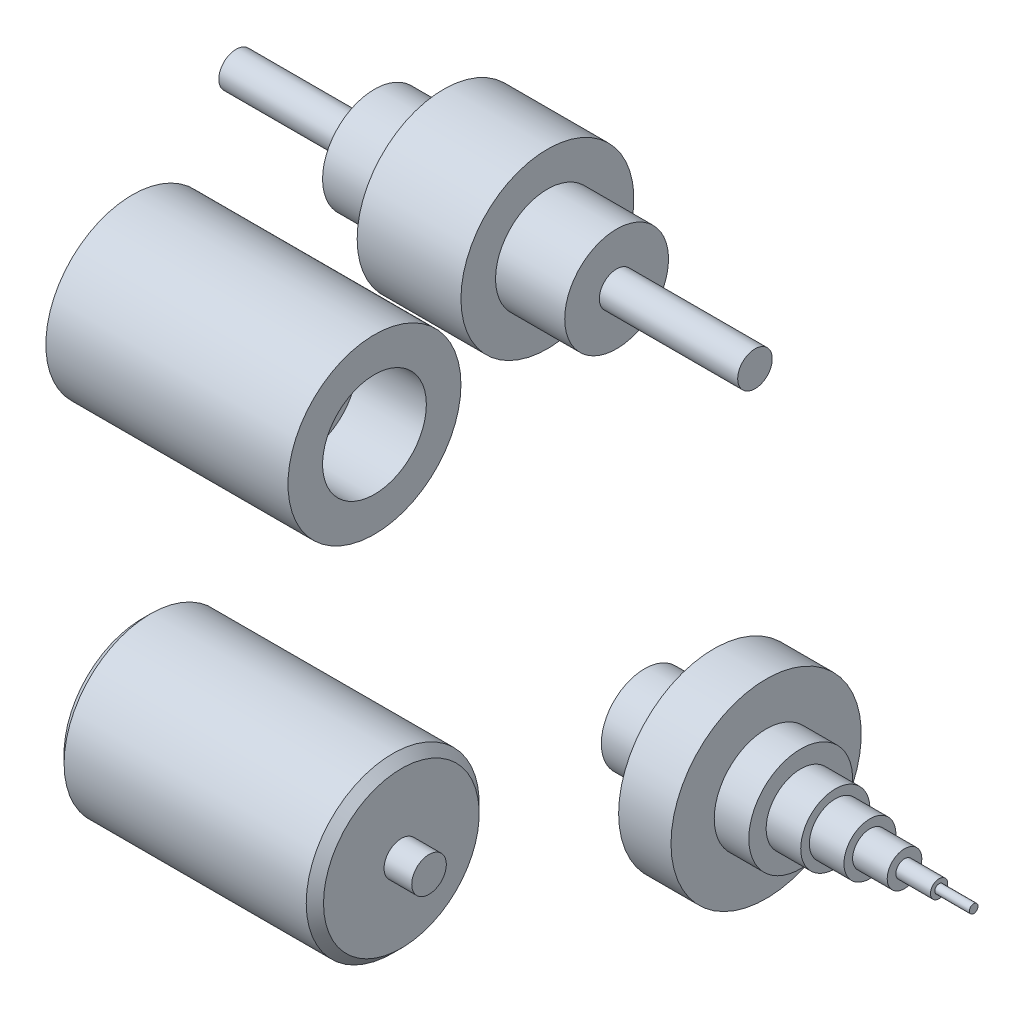
ISO-10303-21;
HEADER;
FILE_DESCRIPTION(('STEP AP214'),'2;1');
FILE_NAME('part.step','',(''),(''),'','','');
FILE_SCHEMA(('AUTOMOTIVE_DESIGN { 1 0 10303 214 1 1 1 1 }'));
ENDSEC;
DATA;
#1=APPLICATION_CONTEXT('core data for automotive mechanical design processes');
#2=APPLICATION_PROTOCOL_DEFINITION('international standard','automotive_design',2000,#1);
#3=PRODUCT_CONTEXT('',#1,'mechanical');
#4=PRODUCT('Part','Part','',(#3));
#5=PRODUCT_RELATED_PRODUCT_CATEGORY('part','',(#4));
#6=PRODUCT_DEFINITION_FORMATION('','',#4);
#7=PRODUCT_DEFINITION_CONTEXT('part definition',#1,'design');
#8=PRODUCT_DEFINITION('design','',#6,#7);
#9=PRODUCT_DEFINITION_SHAPE('','',#8);
#10=(LENGTH_UNIT() NAMED_UNIT(*) SI_UNIT(.MILLI.,.METRE.));
#11=(NAMED_UNIT(*) PLANE_ANGLE_UNIT() SI_UNIT($,.RADIAN.));
#12=(NAMED_UNIT(*) SI_UNIT($,.STERADIAN.) SOLID_ANGLE_UNIT());
#13=UNCERTAINTY_MEASURE_WITH_UNIT(LENGTH_MEASURE(1.E-05),#10,'distance_accuracy_value','');
#14=(GEOMETRIC_REPRESENTATION_CONTEXT(3) GLOBAL_UNCERTAINTY_ASSIGNED_CONTEXT((#13)) GLOBAL_UNIT_ASSIGNED_CONTEXT((#10,
#11,#12)) REPRESENTATION_CONTEXT('',''));
#15=CARTESIAN_POINT('',(0.,0.,0.));
#16=DIRECTION('',(0.,0.,1.));
#17=DIRECTION('',(1.,0.,0.));
#18=AXIS2_PLACEMENT_3D('',#15,#16,#17);
#19=CARTESIAN_POINT('',(-110.390362139245,-415.362975233975,0.));
#20=DIRECTION('',(-1.,0.,0.));
#21=DIRECTION('',(0.,0.,1.));
#22=AXIS2_PLACEMENT_3D('',#19,#20,#21);
#23=CYLINDRICAL_SURFACE('',#22,9.99999999999998);
#24=CARTESIAN_POINT('',(-86.5716986059651,-415.362975233975,0.));
#25=DIRECTION('',(-1.,0.,0.));
#26=DIRECTION('',(0.,0.,1.));
#27=AXIS2_PLACEMENT_3D('',#24,#25,#26);
#28=CIRCLE('',#27,10.);
#29=CARTESIAN_POINT('',(-86.5716986059651,-415.362975233975,10.));
#30=VERTEX_POINT('',#29);
#31=EDGE_CURVE('E62',#30,#30,#28,.T.);
#32=ORIENTED_EDGE('',*,*,#31,.F.);
#33=EDGE_LOOP('',(#32));
#34=FACE_BOUND('',#33,.T.);
#35=CARTESIAN_POINT('',(-70.5716986059651,-415.362975233975,0.));
#36=DIRECTION('',(-1.,0.,0.));
#37=DIRECTION('',(0.,0.,1.));
#38=AXIS2_PLACEMENT_3D('',#35,#36,#37);
#39=CIRCLE('',#38,9.99999999999995);
#40=CARTESIAN_POINT('',(-70.5716986059651,-415.362975233975,9.99999999999995));
#41=VERTEX_POINT('',#40);
#42=EDGE_CURVE('E71',#41,#41,#39,.T.);
#43=ORIENTED_EDGE('',*,*,#42,.T.);
#44=EDGE_LOOP('',(#43));
#45=FACE_BOUND('',#44,.T.);
#46=ADVANCED_FACE('F42',(#34,#45),#23,.T.);
#47=CARTESIAN_POINT('',(-86.5716986059651,-415.362975233975,0.));
#48=DIRECTION('',(1.,0.,0.));
#49=DIRECTION('',(0.,0.,-1.));
#50=AXIS2_PLACEMENT_3D('',#47,#48,#49);
#51=PLANE('',#50);
#52=ORIENTED_EDGE('',*,*,#31,.T.);
#53=EDGE_LOOP('',(#52));
#54=FACE_BOUND('',#53,.T.);
#55=ADVANCED_FACE('F90',(#54),#51,.F.);
#56=CARTESIAN_POINT('',(95.4283013940349,-405.362975233975,0.));
#57=DIRECTION('',(-1.,0.,0.));
#58=DIRECTION('',(0.,0.,1.));
#59=AXIS2_PLACEMENT_3D('',#56,#57,#58);
#60=PLANE('',#59);
#61=CARTESIAN_POINT('',(95.4283013940349,-415.362975233975,0.));
#62=DIRECTION('',(-1.,0.,0.));
#63=DIRECTION('',(0.,0.,1.));
#64=AXIS2_PLACEMENT_3D('',#61,#62,#63);
#65=CIRCLE('',#64,9.99999999999995);
#66=CARTESIAN_POINT('',(95.4283013940349,-415.362975233975,9.99999999999995));
#67=VERTEX_POINT('',#66);
#68=EDGE_CURVE('E65',#67,#67,#65,.T.);
#69=ORIENTED_EDGE('',*,*,#68,.F.);
#70=EDGE_LOOP('',(#69));
#71=FACE_BOUND('',#70,.T.);
#72=ADVANCED_FACE('F96',(#71),#60,.F.);
#73=CARTESIAN_POINT('',(-110.390362139245,-415.362975233975,0.));
#74=DIRECTION('',(-1.,0.,0.));
#75=DIRECTION('',(0.,0.,1.));
#76=AXIS2_PLACEMENT_3D('',#73,#74,#75);
#77=CYLINDRICAL_SURFACE('',#76,9.99999999999995);
#78=CARTESIAN_POINT('',(79.4283013940349,-415.362975233975,0.));
#79=DIRECTION('',(-1.,0.,0.));
#80=DIRECTION('',(0.,0.,1.));
#81=AXIS2_PLACEMENT_3D('',#78,#79,#80);
#82=CIRCLE('',#81,9.99999999999995);
#83=CARTESIAN_POINT('',(79.4283013940349,-415.362975233975,9.99999999999995));
#84=VERTEX_POINT('',#83);
#85=EDGE_CURVE('E68',#84,#84,#82,.T.);
#86=ORIENTED_EDGE('',*,*,#85,.F.);
#87=EDGE_LOOP('',(#86));
#88=FACE_BOUND('',#87,.T.);
#89=ORIENTED_EDGE('',*,*,#68,.T.);
#90=EDGE_LOOP('',(#89));
#91=FACE_BOUND('',#90,.T.);
#92=ADVANCED_FACE('F103',(#88,#91),#77,.T.);
#93=CARTESIAN_POINT('',(79.4283013940349,-365.362975233975,0.));
#94=DIRECTION('',(-1.,0.,0.));
#95=DIRECTION('',(0.,0.,1.));
#96=AXIS2_PLACEMENT_3D('',#93,#94,#95);
#97=PLANE('',#96);
#98=CARTESIAN_POINT('',(79.4283013940349,-415.362975233975,0.));
#99=DIRECTION('',(-1.,0.,0.));
#100=DIRECTION('',(0.,0.,1.));
#101=AXIS2_PLACEMENT_3D('',#98,#99,#100);
#102=CIRCLE('',#101,45.);
#103=CARTESIAN_POINT('',(79.4283013940349,-415.362975233975,45.));
#104=VERTEX_POINT('',#103);
#105=EDGE_CURVE('E11',#104,#104,#102,.F.);
#106=ORIENTED_EDGE('',*,*,#105,.T.);
#107=EDGE_LOOP('',(#106));
#108=FACE_BOUND('',#107,.T.);
#109=ORIENTED_EDGE('',*,*,#85,.T.);
#110=EDGE_LOOP('',(#109));
#111=FACE_BOUND('',#110,.T.);
#112=ADVANCED_FACE('F87',(#108,#111),#97,.F.);
#113=CARTESIAN_POINT('',(-110.390362139245,-415.362975233975,0.));
#114=DIRECTION('',(-1.,0.,0.));
#115=DIRECTION('',(0.,0.,1.));
#116=AXIS2_PLACEMENT_3D('',#113,#114,#115);
#117=CYLINDRICAL_SURFACE('',#116,49.9999999999999);
#118=CARTESIAN_POINT('',(74.4283013940349,-415.362975233975,0.));
#119=DIRECTION('',(-1.,0.,0.));
#120=DIRECTION('',(0.,0.,1.));
#121=AXIS2_PLACEMENT_3D('',#118,#119,#120);
#122=CIRCLE('',#121,49.9999999999999);
#123=CARTESIAN_POINT('',(74.4283013940349,-415.362975233975,49.9999999999999));
#124=VERTEX_POINT('',#123);
#125=EDGE_CURVE('E49',#124,#124,#122,.T.);
#126=ORIENTED_EDGE('',*,*,#125,.T.);
#127=EDGE_LOOP('',(#126));
#128=FACE_BOUND('',#127,.T.);
#129=CARTESIAN_POINT('',(-65.5716986059651,-415.362975233975,0.));
#130=DIRECTION('',(1.,0.,0.));
#131=DIRECTION('',(0.,0.,-1.));
#132=AXIS2_PLACEMENT_3D('',#129,#130,#131);
#133=CIRCLE('',#132,49.9999999999999);
#134=CARTESIAN_POINT('',(-65.5716986059651,-415.362975233975,-49.9999999999999));
#135=VERTEX_POINT('',#134);
#136=EDGE_CURVE('E53',#135,#135,#133,.T.);
#137=ORIENTED_EDGE('',*,*,#136,.T.);
#138=EDGE_LOOP('',(#137));
#139=FACE_BOUND('',#138,.T.);
#140=ADVANCED_FACE('F79',(#128,#139),#117,.T.);
#141=CARTESIAN_POINT('',(-70.5716986059651,-405.362975233975,0.));
#142=DIRECTION('',(1.,0.,0.));
#143=DIRECTION('',(0.,0.,-1.));
#144=AXIS2_PLACEMENT_3D('',#141,#142,#143);
#145=PLANE('',#144);
#146=CARTESIAN_POINT('',(-70.5716986059651,-415.362975233975,0.));
#147=DIRECTION('',(1.,0.,0.));
#148=DIRECTION('',(0.,0.,-1.));
#149=AXIS2_PLACEMENT_3D('',#146,#147,#148);
#150=CIRCLE('',#149,44.9999999999999);
#151=CARTESIAN_POINT('',(-70.5716986059651,-415.362975233975,-44.9999999999999));
#152=VERTEX_POINT('',#151);
#153=EDGE_CURVE('E57',#152,#152,#150,.F.);
#154=ORIENTED_EDGE('',*,*,#153,.T.);
#155=EDGE_LOOP('',(#154));
#156=FACE_BOUND('',#155,.T.);
#157=ORIENTED_EDGE('',*,*,#42,.F.);
#158=EDGE_LOOP('',(#157));
#159=FACE_BOUND('',#158,.T.);
#160=ADVANCED_FACE('F76',(#156,#159),#145,.F.);
#161=CARTESIAN_POINT('',(-70.5716986059651,-415.362975233975,0.));
#162=DIRECTION('',(1.,0.,0.));
#163=DIRECTION('',(0.,0.,-1.));
#164=AXIS2_PLACEMENT_3D('',#161,#162,#163);
#165=CONICAL_SURFACE('',#164,44.9999999999999,0.785398163397446);
#166=ORIENTED_EDGE('',*,*,#136,.F.);
#167=EDGE_LOOP('',(#166));
#168=FACE_BOUND('',#167,.T.);
#169=ORIENTED_EDGE('',*,*,#153,.F.);
#170=EDGE_LOOP('',(#169));
#171=FACE_BOUND('',#170,.T.);
#172=ADVANCED_FACE('F78',(#168,#171),#165,.T.);
#173=CARTESIAN_POINT('',(74.4283013940349,-415.362975233975,0.));
#174=DIRECTION('',(-1.,0.,0.));
#175=DIRECTION('',(0.,0.,1.));
#176=AXIS2_PLACEMENT_3D('',#173,#174,#175);
#177=CONICAL_SURFACE('',#176,49.9999999999999,0.785398163397451);
#178=ORIENTED_EDGE('',*,*,#105,.F.);
#179=EDGE_LOOP('',(#178));
#180=FACE_BOUND('',#179,.T.);
#181=ORIENTED_EDGE('',*,*,#125,.F.);
#182=EDGE_LOOP('',(#181));
#183=FACE_BOUND('',#182,.T.);
#184=ADVANCED_FACE('F44',(#180,#183),#177,.T.);
#185=CLOSED_SHELL('',(#46,#55,#72,#92,#112,#140,#160,#172,#184));
#186=MANIFOLD_SOLID_BREP('B2',#185);
#187=CARTESIAN_POINT('',(410.329396223316,-275.079193053094,0.));
#188=DIRECTION('',(1.,0.,0.));
#189=DIRECTION('',(0.,0.,-1.));
#190=AXIS2_PLACEMENT_3D('',#187,#188,#189);
#191=PLANE('',#190);
#192=CARTESIAN_POINT('',(410.329396223316,-275.079193053094,0.));
#193=DIRECTION('',(-1.,0.,0.));
#194=DIRECTION('',(0.,0.,1.));
#195=AXIS2_PLACEMENT_3D('',#192,#193,#194);
#196=CIRCLE('',#195,2.5);
#197=CARTESIAN_POINT('',(410.329396223316,-275.079193053094,2.5));
#198=VERTEX_POINT('',#197);
#199=EDGE_CURVE('E41',#198,#198,#196,.T.);
#200=ORIENTED_EDGE('',*,*,#199,.F.);
#201=EDGE_LOOP('',(#200));
#202=FACE_BOUND('',#201,.T.);
#203=ADVANCED_FACE('F181',(#202),#191,.T.);
#204=CARTESIAN_POINT('',(141.076094876442,-275.079193053094,0.));
#205=DIRECTION('',(-1.,0.,0.));
#206=DIRECTION('',(0.,0.,1.));
#207=AXIS2_PLACEMENT_3D('',#204,#205,#206);
#208=CYLINDRICAL_SURFACE('',#207,2.50000000000003);
#209=ORIENTED_EDGE('',*,*,#199,.T.);
#210=EDGE_LOOP('',(#209));
#211=FACE_BOUND('',#210,.T.);
#212=CARTESIAN_POINT('',(390.329396223316,-275.079193053094,0.));
#213=DIRECTION('',(-1.,0.,0.));
#214=DIRECTION('',(0.,0.,1.));
#215=AXIS2_PLACEMENT_3D('',#212,#213,#214);
#216=CIRCLE('',#215,2.50000000000006);
#217=CARTESIAN_POINT('',(390.329396223316,-275.079193053094,2.50000000000006));
#218=VERTEX_POINT('',#217);
#219=EDGE_CURVE('E187',#218,#218,#216,.T.);
#220=ORIENTED_EDGE('',*,*,#219,.F.);
#221=EDGE_LOOP('',(#220));
#222=FACE_BOUND('',#221,.T.);
#223=ADVANCED_FACE('F269',(#211,#222),#208,.T.);
#224=CARTESIAN_POINT('',(390.329396223316,-277.579193053094,0.));
#225=DIRECTION('',(1.,0.,0.));
#226=DIRECTION('',(0.,0.,-1.));
#227=AXIS2_PLACEMENT_3D('',#224,#225,#226);
#228=PLANE('',#227);
#229=ORIENTED_EDGE('',*,*,#219,.T.);
#230=EDGE_LOOP('',(#229));
#231=FACE_BOUND('',#230,.T.);
#232=CARTESIAN_POINT('',(390.329396223316,-275.079193053094,0.));
#233=DIRECTION('',(-1.,0.,0.));
#234=DIRECTION('',(0.,0.,1.));
#235=AXIS2_PLACEMENT_3D('',#232,#233,#234);
#236=CIRCLE('',#235,5.);
#237=CARTESIAN_POINT('',(390.329396223316,-275.079193053094,5.));
#238=VERTEX_POINT('',#237);
#239=EDGE_CURVE('E191',#238,#238,#236,.T.);
#240=ORIENTED_EDGE('',*,*,#239,.F.);
#241=EDGE_LOOP('',(#240));
#242=FACE_BOUND('',#241,.T.);
#243=ADVANCED_FACE('F274',(#231,#242),#228,.T.);
#244=CARTESIAN_POINT('',(141.076094876442,-275.079193053094,0.));
#245=DIRECTION('',(-1.,0.,0.));
#246=DIRECTION('',(0.,0.,1.));
#247=AXIS2_PLACEMENT_3D('',#244,#245,#246);
#248=CYLINDRICAL_SURFACE('',#247,5.);
#249=ORIENTED_EDGE('',*,*,#239,.T.);
#250=EDGE_LOOP('',(#249));
#251=FACE_BOUND('',#250,.T.);
#252=CARTESIAN_POINT('',(370.329396223316,-275.079193053094,0.));
#253=DIRECTION('',(-1.,0.,0.));
#254=DIRECTION('',(0.,0.,1.));
#255=AXIS2_PLACEMENT_3D('',#252,#253,#254);
#256=CIRCLE('',#255,5.);
#257=CARTESIAN_POINT('',(370.329396223316,-275.079193053094,5.));
#258=VERTEX_POINT('',#257);
#259=EDGE_CURVE('E195',#258,#258,#256,.T.);
#260=ORIENTED_EDGE('',*,*,#259,.F.);
#261=EDGE_LOOP('',(#260));
#262=FACE_BOUND('',#261,.T.);
#263=ADVANCED_FACE('F278',(#251,#262),#248,.T.);
#264=CARTESIAN_POINT('',(370.329396223316,-280.079193053094,0.));
#265=DIRECTION('',(1.,0.,0.));
#266=DIRECTION('',(0.,0.,-1.));
#267=AXIS2_PLACEMENT_3D('',#264,#265,#266);
#268=PLANE('',#267);
#269=ORIENTED_EDGE('',*,*,#259,.T.);
#270=EDGE_LOOP('',(#269));
#271=FACE_BOUND('',#270,.T.);
#272=CARTESIAN_POINT('',(370.329396223316,-275.079193053094,0.));
#273=DIRECTION('',(-1.,0.,0.));
#274=DIRECTION('',(0.,0.,1.));
#275=AXIS2_PLACEMENT_3D('',#272,#273,#274);
#276=CIRCLE('',#275,10.);
#277=CARTESIAN_POINT('',(370.329396223316,-275.079193053094,10.));
#278=VERTEX_POINT('',#277);
#279=EDGE_CURVE('E200',#278,#278,#276,.T.);
#280=ORIENTED_EDGE('',*,*,#279,.F.);
#281=EDGE_LOOP('',(#280));
#282=FACE_BOUND('',#281,.T.);
#283=ADVANCED_FACE('F284',(#271,#282),#268,.T.);
#284=CARTESIAN_POINT('',(141.076094876442,-275.079193053094,0.));
#285=DIRECTION('',(-1.,0.,0.));
#286=DIRECTION('',(0.,0.,1.));
#287=AXIS2_PLACEMENT_3D('',#284,#285,#286);
#288=CYLINDRICAL_SURFACE('',#287,10.);
#289=ORIENTED_EDGE('',*,*,#279,.T.);
#290=EDGE_LOOP('',(#289));
#291=FACE_BOUND('',#290,.T.);
#292=CARTESIAN_POINT('',(350.329396223316,-275.079193053094,0.));
#293=DIRECTION('',(-1.,0.,0.));
#294=DIRECTION('',(0.,0.,1.));
#295=AXIS2_PLACEMENT_3D('',#292,#293,#294);
#296=CIRCLE('',#295,10.);
#297=CARTESIAN_POINT('',(350.329396223316,-275.079193053094,10.));
#298=VERTEX_POINT('',#297);
#299=EDGE_CURVE('E203',#298,#298,#296,.T.);
#300=ORIENTED_EDGE('',*,*,#299,.F.);
#301=EDGE_LOOP('',(#300));
#302=FACE_BOUND('',#301,.T.);
#303=ADVANCED_FACE('F288',(#291,#302),#288,.T.);
#304=CARTESIAN_POINT('',(350.329396223316,-285.079193053094,0.));
#305=DIRECTION('',(1.,0.,0.));
#306=DIRECTION('',(0.,0.,-1.));
#307=AXIS2_PLACEMENT_3D('',#304,#305,#306);
#308=PLANE('',#307);
#309=ORIENTED_EDGE('',*,*,#299,.T.);
#310=EDGE_LOOP('',(#309));
#311=FACE_BOUND('',#310,.T.);
#312=CARTESIAN_POINT('',(350.329396223316,-275.079193053094,0.));
#313=DIRECTION('',(-1.,0.,0.));
#314=DIRECTION('',(0.,0.,1.));
#315=AXIS2_PLACEMENT_3D('',#312,#313,#314);
#316=CIRCLE('',#315,15.);
#317=CARTESIAN_POINT('',(350.329396223316,-275.079193053094,15.));
#318=VERTEX_POINT('',#317);
#319=EDGE_CURVE('E206',#318,#318,#316,.T.);
#320=ORIENTED_EDGE('',*,*,#319,.F.);
#321=EDGE_LOOP('',(#320));
#322=FACE_BOUND('',#321,.T.);
#323=ADVANCED_FACE('F292',(#311,#322),#308,.T.);
#324=CARTESIAN_POINT('',(141.076094876442,-275.079193053094,0.));
#325=DIRECTION('',(-1.,0.,0.));
#326=DIRECTION('',(0.,0.,1.));
#327=AXIS2_PLACEMENT_3D('',#324,#325,#326);
#328=CYLINDRICAL_SURFACE('',#327,15.);
#329=ORIENTED_EDGE('',*,*,#319,.T.);
#330=EDGE_LOOP('',(#329));
#331=FACE_BOUND('',#330,.T.);
#332=CARTESIAN_POINT('',(330.329396223316,-275.079193053094,0.));
#333=DIRECTION('',(-1.,0.,0.));
#334=DIRECTION('',(0.,0.,1.));
#335=AXIS2_PLACEMENT_3D('',#332,#333,#334);
#336=CIRCLE('',#335,15.);
#337=CARTESIAN_POINT('',(330.329396223316,-275.079193053094,15.));
#338=VERTEX_POINT('',#337);
#339=EDGE_CURVE('E209',#338,#338,#336,.T.);
#340=ORIENTED_EDGE('',*,*,#339,.F.);
#341=EDGE_LOOP('',(#340));
#342=FACE_BOUND('',#341,.T.);
#343=ADVANCED_FACE('F296',(#331,#342),#328,.T.);
#344=CARTESIAN_POINT('',(330.329396223316,-290.079193053094,0.));
#345=DIRECTION('',(1.,0.,0.));
#346=DIRECTION('',(0.,0.,-1.));
#347=AXIS2_PLACEMENT_3D('',#344,#345,#346);
#348=PLANE('',#347);
#349=ORIENTED_EDGE('',*,*,#339,.T.);
#350=EDGE_LOOP('',(#349));
#351=FACE_BOUND('',#350,.T.);
#352=CARTESIAN_POINT('',(330.329396223316,-275.079193053094,0.));
#353=DIRECTION('',(-1.,0.,0.));
#354=DIRECTION('',(0.,0.,1.));
#355=AXIS2_PLACEMENT_3D('',#352,#353,#354);
#356=CIRCLE('',#355,20.);
#357=CARTESIAN_POINT('',(330.329396223316,-275.079193053094,20.));
#358=VERTEX_POINT('',#357);
#359=EDGE_CURVE('E212',#358,#358,#356,.T.);
#360=ORIENTED_EDGE('',*,*,#359,.F.);
#361=EDGE_LOOP('',(#360));
#362=FACE_BOUND('',#361,.T.);
#363=ADVANCED_FACE('F300',(#351,#362),#348,.T.);
#364=CARTESIAN_POINT('',(141.076094876442,-275.079193053094,0.));
#365=DIRECTION('',(-1.,0.,0.));
#366=DIRECTION('',(0.,0.,1.));
#367=AXIS2_PLACEMENT_3D('',#364,#365,#366);
#368=CYLINDRICAL_SURFACE('',#367,20.);
#369=ORIENTED_EDGE('',*,*,#359,.T.);
#370=EDGE_LOOP('',(#369));
#371=FACE_BOUND('',#370,.T.);
#372=CARTESIAN_POINT('',(310.329396223316,-275.079193053094,0.));
#373=DIRECTION('',(-1.,0.,0.));
#374=DIRECTION('',(0.,0.,1.));
#375=AXIS2_PLACEMENT_3D('',#372,#373,#374);
#376=CIRCLE('',#375,20.);
#377=CARTESIAN_POINT('',(310.329396223316,-275.079193053094,20.));
#378=VERTEX_POINT('',#377);
#379=EDGE_CURVE('E215',#378,#378,#376,.T.);
#380=ORIENTED_EDGE('',*,*,#379,.F.);
#381=EDGE_LOOP('',(#380));
#382=FACE_BOUND('',#381,.T.);
#383=ADVANCED_FACE('F304',(#371,#382),#368,.T.);
#384=CARTESIAN_POINT('',(310.329396223316,-295.079193053094,0.));
#385=DIRECTION('',(1.,0.,0.));
#386=DIRECTION('',(0.,0.,-1.));
#387=AXIS2_PLACEMENT_3D('',#384,#385,#386);
#388=PLANE('',#387);
#389=ORIENTED_EDGE('',*,*,#379,.T.);
#390=EDGE_LOOP('',(#389));
#391=FACE_BOUND('',#390,.T.);
#392=CARTESIAN_POINT('',(310.329396223316,-275.079193053094,0.));
#393=DIRECTION('',(-1.,0.,0.));
#394=DIRECTION('',(0.,0.,1.));
#395=AXIS2_PLACEMENT_3D('',#392,#393,#394);
#396=CIRCLE('',#395,30.);
#397=CARTESIAN_POINT('',(310.329396223316,-275.079193053094,30.));
#398=VERTEX_POINT('',#397);
#399=EDGE_CURVE('E218',#398,#398,#396,.T.);
#400=ORIENTED_EDGE('',*,*,#399,.F.);
#401=EDGE_LOOP('',(#400));
#402=FACE_BOUND('',#401,.T.);
#403=ADVANCED_FACE('F308',(#391,#402),#388,.T.);
#404=CARTESIAN_POINT('',(141.076094876442,-275.079193053094,0.));
#405=DIRECTION('',(-1.,0.,0.));
#406=DIRECTION('',(0.,0.,1.));
#407=AXIS2_PLACEMENT_3D('',#404,#405,#406);
#408=CYLINDRICAL_SURFACE('',#407,30.);
#409=ORIENTED_EDGE('',*,*,#399,.T.);
#410=EDGE_LOOP('',(#409));
#411=FACE_BOUND('',#410,.T.);
#412=CARTESIAN_POINT('',(290.329396223316,-275.079193053094,0.));
#413=DIRECTION('',(-1.,0.,0.));
#414=DIRECTION('',(0.,0.,1.));
#415=AXIS2_PLACEMENT_3D('',#412,#413,#414);
#416=CIRCLE('',#415,30.);
#417=CARTESIAN_POINT('',(290.329396223316,-275.079193053094,30.));
#418=VERTEX_POINT('',#417);
#419=EDGE_CURVE('E221',#418,#418,#416,.T.);
#420=ORIENTED_EDGE('',*,*,#419,.F.);
#421=EDGE_LOOP('',(#420));
#422=FACE_BOUND('',#421,.T.);
#423=ADVANCED_FACE('F312',(#411,#422),#408,.T.);
#424=CARTESIAN_POINT('',(290.329396223316,-305.079193053094,0.));
#425=DIRECTION('',(1.,0.,0.));
#426=DIRECTION('',(0.,0.,-1.));
#427=AXIS2_PLACEMENT_3D('',#424,#425,#426);
#428=PLANE('',#427);
#429=ORIENTED_EDGE('',*,*,#419,.T.);
#430=EDGE_LOOP('',(#429));
#431=FACE_BOUND('',#430,.T.);
#432=CARTESIAN_POINT('',(290.329396223316,-275.079193053094,0.));
#433=DIRECTION('',(-1.,0.,0.));
#434=DIRECTION('',(0.,0.,1.));
#435=AXIS2_PLACEMENT_3D('',#432,#433,#434);
#436=CIRCLE('',#435,54.9999999999999);
#437=CARTESIAN_POINT('',(290.329396223316,-275.079193053094,54.9999999999999));
#438=VERTEX_POINT('',#437);
#439=EDGE_CURVE('E224',#438,#438,#436,.T.);
#440=ORIENTED_EDGE('',*,*,#439,.F.);
#441=EDGE_LOOP('',(#440));
#442=FACE_BOUND('',#441,.T.);
#443=ADVANCED_FACE('F316',(#431,#442),#428,.T.);
#444=CARTESIAN_POINT('',(141.076094876442,-275.079193053094,0.));
#445=DIRECTION('',(-1.,0.,0.));
#446=DIRECTION('',(0.,0.,1.));
#447=AXIS2_PLACEMENT_3D('',#444,#445,#446);
#448=CYLINDRICAL_SURFACE('',#447,54.9999999999999);
#449=ORIENTED_EDGE('',*,*,#439,.T.);
#450=EDGE_LOOP('',(#449));
#451=FACE_BOUND('',#450,.T.);
#452=CARTESIAN_POINT('',(260.048278243526,-275.079193053094,0.));
#453=DIRECTION('',(-1.,0.,0.));
#454=DIRECTION('',(0.,0.,1.));
#455=AXIS2_PLACEMENT_3D('',#452,#453,#454);
#456=CIRCLE('',#455,54.9999999999999);
#457=CARTESIAN_POINT('',(260.048278243526,-275.079193053094,54.9999999999999));
#458=VERTEX_POINT('',#457);
#459=EDGE_CURVE('E227',#458,#458,#456,.T.);
#460=ORIENTED_EDGE('',*,*,#459,.F.);
#461=EDGE_LOOP('',(#460));
#462=FACE_BOUND('',#461,.T.);
#463=ADVANCED_FACE('F265',(#451,#462),#448,.T.);
#464=CARTESIAN_POINT('',(260.048278243526,-330.079193053094,0.));
#465=DIRECTION('',(-1.,0.,0.));
#466=DIRECTION('',(0.,0.,1.));
#467=AXIS2_PLACEMENT_3D('',#464,#465,#466);
#468=PLANE('',#467);
#469=ORIENTED_EDGE('',*,*,#459,.T.);
#470=EDGE_LOOP('',(#469));
#471=FACE_BOUND('',#470,.T.);
#472=CARTESIAN_POINT('',(260.048278243526,-275.079193053094,0.));
#473=DIRECTION('',(-1.,0.,0.));
#474=DIRECTION('',(0.,0.,1.));
#475=AXIS2_PLACEMENT_3D('',#472,#473,#474);
#476=CIRCLE('',#475,25.0000000000001);
#477=CARTESIAN_POINT('',(260.048278243526,-275.079193053094,25.0000000000001));
#478=VERTEX_POINT('',#477);
#479=EDGE_CURVE('E230',#478,#478,#476,.T.);
#480=ORIENTED_EDGE('',*,*,#479,.F.);
#481=EDGE_LOOP('',(#480));
#482=FACE_BOUND('',#481,.T.);
#483=ADVANCED_FACE('F259',(#471,#482),#468,.T.);
#484=CARTESIAN_POINT('',(141.076094876442,-275.079193053094,0.));
#485=DIRECTION('',(-1.,0.,0.));
#486=DIRECTION('',(0.,0.,1.));
#487=AXIS2_PLACEMENT_3D('',#484,#485,#486);
#488=CYLINDRICAL_SURFACE('',#487,25.0000000000001);
#489=ORIENTED_EDGE('',*,*,#479,.T.);
#490=EDGE_LOOP('',(#489));
#491=FACE_BOUND('',#490,.T.);
#492=CARTESIAN_POINT('',(220.048278243526,-275.079193053094,0.));
#493=DIRECTION('',(-1.,0.,0.));
#494=DIRECTION('',(0.,0.,1.));
#495=AXIS2_PLACEMENT_3D('',#492,#493,#494);
#496=CIRCLE('',#495,25.0000000000001);
#497=CARTESIAN_POINT('',(220.048278243526,-275.079193053094,25.0000000000001));
#498=VERTEX_POINT('',#497);
#499=EDGE_CURVE('E233',#498,#498,#496,.T.);
#500=ORIENTED_EDGE('',*,*,#499,.F.);
#501=EDGE_LOOP('',(#500));
#502=FACE_BOUND('',#501,.T.);
#503=ADVANCED_FACE('F254',(#491,#502),#488,.T.);
#504=CARTESIAN_POINT('',(220.048278243526,-300.079193053094,0.));
#505=DIRECTION('',(-1.,0.,0.));
#506=DIRECTION('',(0.,0.,1.));
#507=AXIS2_PLACEMENT_3D('',#504,#505,#506);
#508=PLANE('',#507);
#509=CARTESIAN_POINT('',(220.048278243526,-275.079193053094,0.));
#510=DIRECTION('',(-1.,0.,0.));
#511=DIRECTION('',(0.,0.,1.));
#512=AXIS2_PLACEMENT_3D('',#509,#510,#511);
#513=CIRCLE('',#512,20.);
#514=CARTESIAN_POINT('',(220.048278243526,-275.079193053094,20.));
#515=VERTEX_POINT('',#514);
#516=EDGE_CURVE('E237',#515,#515,#513,.T.);
#517=ORIENTED_EDGE('',*,*,#516,.F.);
#518=EDGE_LOOP('',(#517));
#519=FACE_BOUND('',#518,.T.);
#520=ORIENTED_EDGE('',*,*,#499,.T.);
#521=EDGE_LOOP('',(#520));
#522=FACE_BOUND('',#521,.T.);
#523=ADVANCED_FACE('F248',(#519,#522),#508,.T.);
#524=CARTESIAN_POINT('',(263.048278243526,-275.079193053094,0.));
#525=DIRECTION('',(-1.,0.,0.));
#526=DIRECTION('',(0.,0.,1.));
#527=AXIS2_PLACEMENT_3D('',#524,#525,#526);
#528=CYLINDRICAL_SURFACE('',#527,20.);
#529=CARTESIAN_POINT('',(263.048278243526,-275.079193053094,0.));
#530=DIRECTION('',(-1.,0.,0.));
#531=DIRECTION('',(0.,0.,1.));
#532=AXIS2_PLACEMENT_3D('',#529,#530,#531);
#533=CIRCLE('',#532,20.);
#534=CARTESIAN_POINT('',(263.048278243526,-275.079193053094,20.));
#535=VERTEX_POINT('',#534);
#536=EDGE_CURVE('E236',#535,#535,#533,.T.);
#537=ORIENTED_EDGE('',*,*,#536,.F.);
#538=EDGE_LOOP('',(#537));
#539=FACE_BOUND('',#538,.T.);
#540=ORIENTED_EDGE('',*,*,#516,.T.);
#541=EDGE_LOOP('',(#540));
#542=FACE_BOUND('',#541,.T.);
#543=ADVANCED_FACE('F245',(#539,#542),#528,.F.);
#544=CARTESIAN_POINT('',(263.048278243526,-275.079193053094,0.));
#545=DIRECTION('',(-1.,0.,0.));
#546=DIRECTION('',(0.,0.,1.));
#547=AXIS2_PLACEMENT_3D('',#544,#545,#546);
#548=PLANE('',#547);
#549=ORIENTED_EDGE('',*,*,#536,.T.);
#550=EDGE_LOOP('',(#549));
#551=FACE_BOUND('',#550,.T.);
#552=ADVANCED_FACE('F243',(#551),#548,.T.);
#553=CLOSED_SHELL('',(#203,#223,#243,#263,#283,#303,#323,#343,#363,#383,#403,#423,#443,#463,
#483,#503,#523,#543,#552));
#554=MANIFOLD_SOLID_BREP('B6',#553);
#555=CARTESIAN_POINT('',(-76.1176908132204,0.,0.));
#556=DIRECTION('',(-1.,0.,0.));
#557=DIRECTION('',(0.,0.,1.));
#558=AXIS2_PLACEMENT_3D('',#555,#556,#557);
#559=PLANE('',#558);
#560=CARTESIAN_POINT('',(-76.1176908132204,-210.867194058238,0.));
#561=DIRECTION('',(1.,0.,0.));
#562=DIRECTION('',(0.,0.,-1.));
#563=AXIS2_PLACEMENT_3D('',#560,#561,#562);
#564=CIRCLE('',#563,50.);
#565=CARTESIAN_POINT('',(-76.1176908132204,-210.867194058238,-50.));
#566=VERTEX_POINT('',#565);
#567=EDGE_CURVE('E180',#566,#566,#564,.T.);
#568=ORIENTED_EDGE('',*,*,#567,.F.);
#569=EDGE_LOOP('',(#568));
#570=FACE_BOUND('',#569,.T.);
#571=ADVANCED_FACE('F469',(#570),#559,.T.);
#572=CARTESIAN_POINT('',(101.470830930927,-210.867194058238,0.));
#573=DIRECTION('',(1.,0.,0.));
#574=DIRECTION('',(0.,0.,-1.));
#575=AXIS2_PLACEMENT_3D('',#572,#573,#574);
#576=CYLINDRICAL_SURFACE('',#575,50.);
#577=ORIENTED_EDGE('',*,*,#567,.T.);
#578=EDGE_LOOP('',(#577));
#579=FACE_BOUND('',#578,.T.);
#580=CARTESIAN_POINT('',(63.8823091867796,-210.867194058238,0.));
#581=DIRECTION('',(1.,0.,0.));
#582=DIRECTION('',(0.,0.,-1.));
#583=AXIS2_PLACEMENT_3D('',#580,#581,#582);
#584=CIRCLE('',#583,50.);
#585=CARTESIAN_POINT('',(63.8823091867796,-210.867194058238,-50.));
#586=VERTEX_POINT('',#585);
#587=EDGE_CURVE('E475',#586,#586,#584,.T.);
#588=ORIENTED_EDGE('',*,*,#587,.F.);
#589=EDGE_LOOP('',(#588));
#590=FACE_BOUND('',#589,.T.);
#591=ADVANCED_FACE('F511',(#579,#590),#576,.T.);
#592=CARTESIAN_POINT('',(63.8823091867796,0.,0.));
#593=DIRECTION('',(1.,0.,0.));
#594=DIRECTION('',(0.,0.,-1.));
#595=AXIS2_PLACEMENT_3D('',#592,#593,#594);
#596=PLANE('',#595);
#597=ORIENTED_EDGE('',*,*,#587,.T.);
#598=EDGE_LOOP('',(#597));
#599=FACE_BOUND('',#598,.T.);
#600=CARTESIAN_POINT('',(63.8823091867796,-210.867194058238,0.));
#601=DIRECTION('',(1.,0.,0.));
#602=DIRECTION('',(0.,0.,-1.));
#603=AXIS2_PLACEMENT_3D('',#600,#601,#602);
#604=CIRCLE('',#603,30.);
#605=CARTESIAN_POINT('',(63.8823091867796,-210.867194058238,-30.));
#606=VERTEX_POINT('',#605);
#607=EDGE_CURVE('E479',#606,#606,#604,.T.);
#608=ORIENTED_EDGE('',*,*,#607,.F.);
#609=EDGE_LOOP('',(#608));
#610=FACE_BOUND('',#609,.T.);
#611=ADVANCED_FACE('F516',(#599,#610),#596,.T.);
#612=CARTESIAN_POINT('',(101.470830930927,-210.867194058238,0.));
#613=DIRECTION('',(1.,0.,0.));
#614=DIRECTION('',(0.,0.,-1.));
#615=AXIS2_PLACEMENT_3D('',#612,#613,#614);
#616=CYLINDRICAL_SURFACE('',#615,30.);
#617=ORIENTED_EDGE('',*,*,#607,.T.);
#618=EDGE_LOOP('',(#617));
#619=FACE_BOUND('',#618,.T.);
#620=CARTESIAN_POINT('',(23.8823091867796,-210.867194058238,0.));
#621=DIRECTION('',(1.,0.,0.));
#622=DIRECTION('',(0.,0.,-1.));
#623=AXIS2_PLACEMENT_3D('',#620,#621,#622);
#624=CIRCLE('',#623,30.);
#625=CARTESIAN_POINT('',(23.8823091867796,-210.867194058238,-30.));
#626=VERTEX_POINT('',#625);
#627=EDGE_CURVE('E483',#626,#626,#624,.T.);
#628=ORIENTED_EDGE('',*,*,#627,.F.);
#629=EDGE_LOOP('',(#628));
#630=FACE_BOUND('',#629,.T.);
#631=ADVANCED_FACE('F507',(#619,#630),#616,.F.);
#632=CARTESIAN_POINT('',(23.8823091867796,0.,0.));
#633=DIRECTION('',(1.,0.,0.));
#634=DIRECTION('',(0.,0.,-1.));
#635=AXIS2_PLACEMENT_3D('',#632,#633,#634);
#636=PLANE('',#635);
#637=ORIENTED_EDGE('',*,*,#627,.T.);
#638=EDGE_LOOP('',(#637));
#639=FACE_BOUND('',#638,.T.);
#640=CARTESIAN_POINT('',(23.8823091867796,-210.867194058238,0.));
#641=DIRECTION('',(1.,0.,0.));
#642=DIRECTION('',(0.,0.,-1.));
#643=AXIS2_PLACEMENT_3D('',#640,#641,#642);
#644=CIRCLE('',#643,9.99999999999998);
#645=CARTESIAN_POINT('',(23.8823091867796,-210.867194058238,-9.99999999999998));
#646=VERTEX_POINT('',#645);
#647=EDGE_CURVE('E488',#646,#646,#644,.T.);
#648=ORIENTED_EDGE('',*,*,#647,.F.);
#649=EDGE_LOOP('',(#648));
#650=FACE_BOUND('',#649,.T.);
#651=ADVANCED_FACE('F499',(#639,#650),#636,.T.);
#652=CARTESIAN_POINT('',(101.470830930927,-210.867194058238,0.));
#653=DIRECTION('',(1.,0.,0.));
#654=DIRECTION('',(0.,0.,-1.));
#655=AXIS2_PLACEMENT_3D('',#652,#653,#654);
#656=CYLINDRICAL_SURFACE('',#655,9.99999999999998);
#657=ORIENTED_EDGE('',*,*,#647,.T.);
#658=EDGE_LOOP('',(#657));
#659=FACE_BOUND('',#658,.T.);
#660=CARTESIAN_POINT('',(-56.1176908132204,-210.867194058238,0.));
#661=DIRECTION('',(1.,0.,0.));
#662=DIRECTION('',(0.,0.,-1.));
#663=AXIS2_PLACEMENT_3D('',#660,#661,#662);
#664=CIRCLE('',#663,9.99999999999998);
#665=CARTESIAN_POINT('',(-56.1176908132204,-210.867194058238,-9.99999999999998));
#666=VERTEX_POINT('',#665);
#667=EDGE_CURVE('E491',#666,#666,#664,.T.);
#668=ORIENTED_EDGE('',*,*,#667,.F.);
#669=EDGE_LOOP('',(#668));
#670=FACE_BOUND('',#669,.T.);
#671=ADVANCED_FACE('F497',(#659,#670),#656,.F.);
#672=CARTESIAN_POINT('',(-56.1176908132204,0.,0.));
#673=DIRECTION('',(1.,0.,0.));
#674=DIRECTION('',(0.,0.,-1.));
#675=AXIS2_PLACEMENT_3D('',#672,#673,#674);
#676=PLANE('',#675);
#677=ORIENTED_EDGE('',*,*,#667,.T.);
#678=EDGE_LOOP('',(#677));
#679=FACE_BOUND('',#678,.T.);
#680=ADVANCED_FACE('F495',(#679),#676,.T.);
#681=CLOSED_SHELL('',(#571,#591,#611,#631,#651,#671,#680));
#682=MANIFOLD_SOLID_BREP('B36',#681);
#683=CARTESIAN_POINT('',(-16.1176908132205,-57.9976296774626,0.));
#684=DIRECTION('',(1.,0.,0.));
#685=DIRECTION('',(0.,0.,-1.));
#686=AXIS2_PLACEMENT_3D('',#683,#684,#685);
#687=PLANE('',#686);
#688=CARTESIAN_POINT('',(-16.1176908132205,-67.9976296774626,0.));
#689=DIRECTION('',(-1.,0.,0.));
#690=DIRECTION('',(0.,0.,1.));
#691=AXIS2_PLACEMENT_3D('',#688,#689,#690);
#692=CIRCLE('',#691,10.);
#693=CARTESIAN_POINT('',(-16.1176908132205,-67.9976296774626,10.));
#694=VERTEX_POINT('',#693);
#695=EDGE_CURVE('E604',#694,#694,#692,.T.);
#696=ORIENTED_EDGE('',*,*,#695,.T.);
#697=EDGE_LOOP('',(#696));
#698=FACE_BOUND('',#697,.T.);
#699=ADVANCED_FACE('F570',(#698),#687,.F.);
#700=CARTESIAN_POINT('',(283.88230918678,-67.9976296774626,0.));
#701=DIRECTION('',(-1.,0.,0.));
#702=DIRECTION('',(0.,0.,1.));
#703=AXIS2_PLACEMENT_3D('',#700,#701,#702);
#704=PLANE('',#703);
#705=CARTESIAN_POINT('',(283.88230918678,-67.9976296774626,0.));
#706=DIRECTION('',(-1.,0.,0.));
#707=DIRECTION('',(0.,0.,1.));
#708=AXIS2_PLACEMENT_3D('',#705,#706,#707);
#709=CIRCLE('',#708,10.);
#710=CARTESIAN_POINT('',(283.88230918678,-67.9976296774626,10.));
#711=VERTEX_POINT('',#710);
#712=EDGE_CURVE('E468',#711,#711,#709,.T.);
#713=ORIENTED_EDGE('',*,*,#712,.F.);
#714=EDGE_LOOP('',(#713));
#715=FACE_BOUND('',#714,.T.);
#716=ADVANCED_FACE('F658',(#715),#704,.F.);
#717=CARTESIAN_POINT('',(-83.796377595998,-67.9976296774626,0.));
#718=DIRECTION('',(-1.,0.,0.));
#719=DIRECTION('',(0.,0.,1.));
#720=AXIS2_PLACEMENT_3D('',#717,#718,#719);
#721=CYLINDRICAL_SURFACE('',#720,10.);
#722=CARTESIAN_POINT('',(203.88230918678,-67.9976296774626,0.));
#723=DIRECTION('',(-1.,0.,0.));
#724=DIRECTION('',(0.,0.,1.));
#725=AXIS2_PLACEMENT_3D('',#722,#723,#724);
#726=CIRCLE('',#725,10.);
#727=CARTESIAN_POINT('',(203.88230918678,-67.9976296774626,10.));
#728=VERTEX_POINT('',#727);
#729=EDGE_CURVE('E576',#728,#728,#726,.T.);
#730=ORIENTED_EDGE('',*,*,#729,.F.);
#731=EDGE_LOOP('',(#730));
#732=FACE_BOUND('',#731,.T.);
#733=ORIENTED_EDGE('',*,*,#712,.T.);
#734=EDGE_LOOP('',(#733));
#735=FACE_BOUND('',#734,.T.);
#736=ADVANCED_FACE('F653',(#732,#735),#721,.T.);
#737=CARTESIAN_POINT('',(203.88230918678,-57.9976296774626,0.));
#738=DIRECTION('',(-1.,0.,0.));
#739=DIRECTION('',(0.,0.,1.));
#740=AXIS2_PLACEMENT_3D('',#737,#738,#739);
#741=PLANE('',#740);
#742=CARTESIAN_POINT('',(203.88230918678,-67.9976296774626,0.));
#743=DIRECTION('',(-1.,0.,0.));
#744=DIRECTION('',(0.,0.,1.));
#745=AXIS2_PLACEMENT_3D('',#742,#743,#744);
#746=CIRCLE('',#745,30.);
#747=CARTESIAN_POINT('',(203.88230918678,-67.9976296774626,30.));
#748=VERTEX_POINT('',#747);
#749=EDGE_CURVE('E580',#748,#748,#746,.T.);
#750=ORIENTED_EDGE('',*,*,#749,.F.);
#751=EDGE_LOOP('',(#750));
#752=FACE_BOUND('',#751,.T.);
#753=ORIENTED_EDGE('',*,*,#729,.T.);
#754=EDGE_LOOP('',(#753));
#755=FACE_BOUND('',#754,.T.);
#756=ADVANCED_FACE('F648',(#752,#755),#741,.F.);
#757=CARTESIAN_POINT('',(-83.796377595998,-67.9976296774626,0.));
#758=DIRECTION('',(-1.,0.,0.));
#759=DIRECTION('',(0.,0.,1.));
#760=AXIS2_PLACEMENT_3D('',#757,#758,#759);
#761=CYLINDRICAL_SURFACE('',#760,30.);
#762=CARTESIAN_POINT('',(163.882309186779,-67.9976296774626,0.));
#763=DIRECTION('',(-1.,0.,0.));
#764=DIRECTION('',(0.,0.,1.));
#765=AXIS2_PLACEMENT_3D('',#762,#763,#764);
#766=CIRCLE('',#765,30.);
#767=CARTESIAN_POINT('',(163.882309186779,-67.9976296774626,30.));
#768=VERTEX_POINT('',#767);
#769=EDGE_CURVE('E584',#768,#768,#766,.T.);
#770=ORIENTED_EDGE('',*,*,#769,.F.);
#771=EDGE_LOOP('',(#770));
#772=FACE_BOUND('',#771,.T.);
#773=ORIENTED_EDGE('',*,*,#749,.T.);
#774=EDGE_LOOP('',(#773));
#775=FACE_BOUND('',#774,.T.);
#776=ADVANCED_FACE('F642',(#772,#775),#761,.T.);
#777=CARTESIAN_POINT('',(163.882309186779,-37.9976296774626,0.));
#778=DIRECTION('',(-1.,0.,0.));
#779=DIRECTION('',(0.,0.,1.));
#780=AXIS2_PLACEMENT_3D('',#777,#778,#779);
#781=PLANE('',#780);
#782=CARTESIAN_POINT('',(163.88230918678,-67.9976296774626,0.));
#783=DIRECTION('',(-1.,0.,0.));
#784=DIRECTION('',(0.,0.,1.));
#785=AXIS2_PLACEMENT_3D('',#782,#783,#784);
#786=CIRCLE('',#785,50.);
#787=CARTESIAN_POINT('',(163.88230918678,-67.9976296774626,50.));
#788=VERTEX_POINT('',#787);
#789=EDGE_CURVE('E589',#788,#788,#786,.T.);
#790=ORIENTED_EDGE('',*,*,#789,.F.);
#791=EDGE_LOOP('',(#790));
#792=FACE_BOUND('',#791,.T.);
#793=ORIENTED_EDGE('',*,*,#769,.T.);
#794=EDGE_LOOP('',(#793));
#795=FACE_BOUND('',#794,.T.);
#796=ADVANCED_FACE('F636',(#792,#795),#781,.F.);
#797=CARTESIAN_POINT('',(-83.796377595998,-67.9976296774626,0.));
#798=DIRECTION('',(-1.,0.,0.));
#799=DIRECTION('',(0.,0.,1.));
#800=AXIS2_PLACEMENT_3D('',#797,#798,#799);
#801=CYLINDRICAL_SURFACE('',#800,50.);
#802=CARTESIAN_POINT('',(103.88230918678,-67.9976296774626,0.));
#803=DIRECTION('',(-1.,0.,0.));
#804=DIRECTION('',(0.,0.,1.));
#805=AXIS2_PLACEMENT_3D('',#802,#803,#804);
#806=CIRCLE('',#805,50.);
#807=CARTESIAN_POINT('',(103.88230918678,-67.9976296774626,50.));
#808=VERTEX_POINT('',#807);
#809=EDGE_CURVE('E592',#808,#808,#806,.T.);
#810=ORIENTED_EDGE('',*,*,#809,.F.);
#811=EDGE_LOOP('',(#810));
#812=FACE_BOUND('',#811,.T.);
#813=ORIENTED_EDGE('',*,*,#789,.T.);
#814=EDGE_LOOP('',(#813));
#815=FACE_BOUND('',#814,.T.);
#816=ADVANCED_FACE('F630',(#812,#815),#801,.T.);
#817=CARTESIAN_POINT('',(103.88230918678,-17.9976296774626,0.));
#818=DIRECTION('',(1.,0.,0.));
#819=DIRECTION('',(0.,0.,-1.));
#820=AXIS2_PLACEMENT_3D('',#817,#818,#819);
#821=PLANE('',#820);
#822=CARTESIAN_POINT('',(103.88230918678,-67.9976296774626,0.));
#823=DIRECTION('',(-1.,0.,0.));
#824=DIRECTION('',(0.,0.,1.));
#825=AXIS2_PLACEMENT_3D('',#822,#823,#824);
#826=CIRCLE('',#825,30.0000000000001);
#827=CARTESIAN_POINT('',(103.88230918678,-67.9976296774626,30.0000000000001));
#828=VERTEX_POINT('',#827);
#829=EDGE_CURVE('E595',#828,#828,#826,.T.);
#830=ORIENTED_EDGE('',*,*,#829,.F.);
#831=EDGE_LOOP('',(#830));
#832=FACE_BOUND('',#831,.T.);
#833=ORIENTED_EDGE('',*,*,#809,.T.);
#834=EDGE_LOOP('',(#833));
#835=FACE_BOUND('',#834,.T.);
#836=ADVANCED_FACE('F624',(#832,#835),#821,.F.);
#837=CARTESIAN_POINT('',(-83.796377595998,-67.9976296774626,0.));
#838=DIRECTION('',(-1.,0.,0.));
#839=DIRECTION('',(0.,0.,1.));
#840=AXIS2_PLACEMENT_3D('',#837,#838,#839);
#841=CYLINDRICAL_SURFACE('',#840,30.);
#842=CARTESIAN_POINT('',(63.8823091867796,-67.9976296774626,0.));
#843=DIRECTION('',(-1.,0.,0.));
#844=DIRECTION('',(0.,0.,1.));
#845=AXIS2_PLACEMENT_3D('',#842,#843,#844);
#846=CIRCLE('',#845,30.);
#847=CARTESIAN_POINT('',(63.8823091867796,-67.9976296774626,30.));
#848=VERTEX_POINT('',#847);
#849=EDGE_CURVE('E598',#848,#848,#846,.T.);
#850=ORIENTED_EDGE('',*,*,#849,.F.);
#851=EDGE_LOOP('',(#850));
#852=FACE_BOUND('',#851,.T.);
#853=ORIENTED_EDGE('',*,*,#829,.T.);
#854=EDGE_LOOP('',(#853));
#855=FACE_BOUND('',#854,.T.);
#856=ADVANCED_FACE('F618',(#852,#855),#841,.T.);
#857=CARTESIAN_POINT('',(63.8823091867795,-37.9976296774626,0.));
#858=DIRECTION('',(1.,0.,0.));
#859=DIRECTION('',(0.,0.,-1.));
#860=AXIS2_PLACEMENT_3D('',#857,#858,#859);
#861=PLANE('',#860);
#862=CARTESIAN_POINT('',(63.8823091867796,-67.9976296774626,0.));
#863=DIRECTION('',(-1.,0.,0.));
#864=DIRECTION('',(0.,0.,1.));
#865=AXIS2_PLACEMENT_3D('',#862,#863,#864);
#866=CIRCLE('',#865,10.);
#867=CARTESIAN_POINT('',(63.8823091867796,-67.9976296774626,10.));
#868=VERTEX_POINT('',#867);
#869=EDGE_CURVE('E601',#868,#868,#866,.T.);
#870=ORIENTED_EDGE('',*,*,#869,.F.);
#871=EDGE_LOOP('',(#870));
#872=FACE_BOUND('',#871,.T.);
#873=ORIENTED_EDGE('',*,*,#849,.T.);
#874=EDGE_LOOP('',(#873));
#875=FACE_BOUND('',#874,.T.);
#876=ADVANCED_FACE('F612',(#872,#875),#861,.F.);
#877=CARTESIAN_POINT('',(-83.796377595998,-67.9976296774626,0.));
#878=DIRECTION('',(-1.,0.,0.));
#879=DIRECTION('',(0.,0.,1.));
#880=AXIS2_PLACEMENT_3D('',#877,#878,#879);
#881=CYLINDRICAL_SURFACE('',#880,10.);
#882=ORIENTED_EDGE('',*,*,#695,.F.);
#883=EDGE_LOOP('',(#882));
#884=FACE_BOUND('',#883,.T.);
#885=ORIENTED_EDGE('',*,*,#869,.T.);
#886=EDGE_LOOP('',(#885));
#887=FACE_BOUND('',#886,.T.);
#888=ADVANCED_FACE('F609',(#884,#887),#881,.T.);
#889=CLOSED_SHELL('',(#699,#716,#736,#756,#776,#796,#816,#836,#856,#876,#888));
#890=MANIFOLD_SOLID_BREP('B175',#889);
#891=ADVANCED_BREP_SHAPE_REPRESENTATION('',(#18,#186,#554,#682,#890),#14);
#892=SHAPE_DEFINITION_REPRESENTATION(#9,#891);
ENDSEC;
END-ISO-10303-21;
